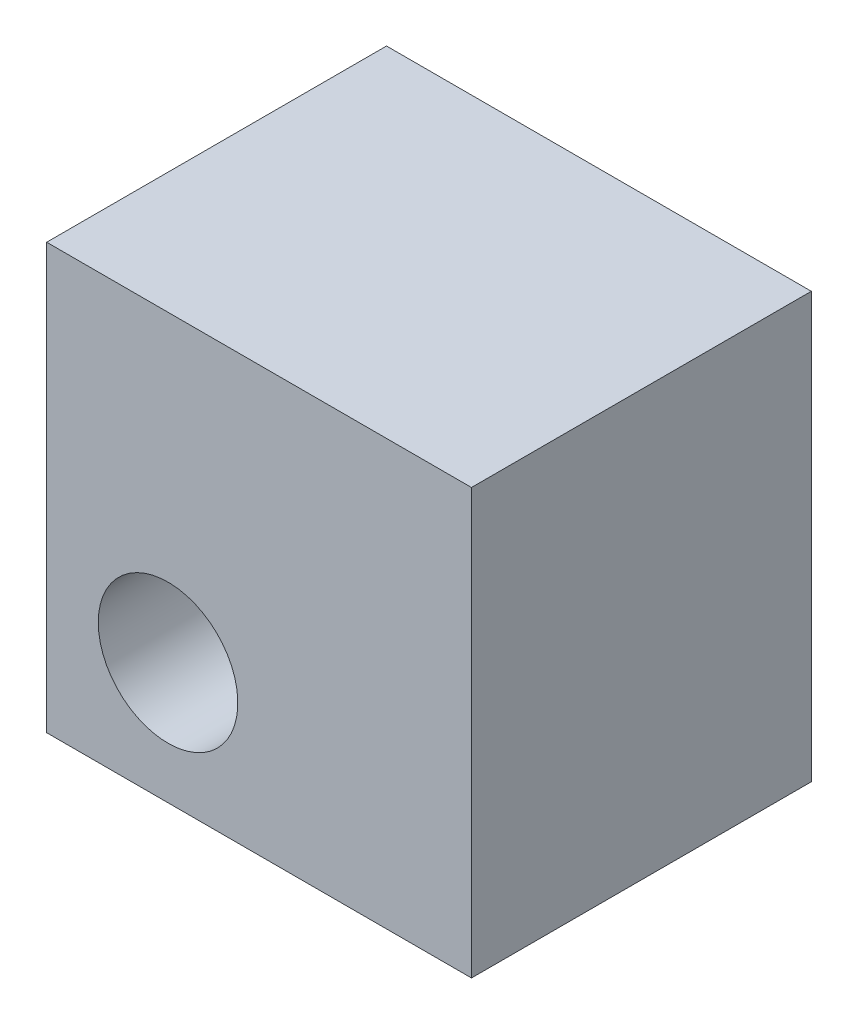
ISO-10303-21;
HEADER;
FILE_DESCRIPTION(('STEP AP214'),'2;1');
FILE_NAME('part.step','',(''),(''),'','','');
FILE_SCHEMA(('AUTOMOTIVE_DESIGN { 1 0 10303 214 1 1 1 1 }'));
ENDSEC;
DATA;
#1=APPLICATION_CONTEXT('core data for automotive mechanical design processes');
#2=APPLICATION_PROTOCOL_DEFINITION('international standard','automotive_design',2000,#1);
#3=PRODUCT_CONTEXT('',#1,'mechanical');
#4=PRODUCT('Part','Part','',(#3));
#5=PRODUCT_RELATED_PRODUCT_CATEGORY('part','',(#4));
#6=PRODUCT_DEFINITION_FORMATION('','',#4);
#7=PRODUCT_DEFINITION_CONTEXT('part definition',#1,'design');
#8=PRODUCT_DEFINITION('design','',#6,#7);
#9=PRODUCT_DEFINITION_SHAPE('','',#8);
#10=(LENGTH_UNIT() NAMED_UNIT(*) SI_UNIT(.MILLI.,.METRE.));
#11=(NAMED_UNIT(*) PLANE_ANGLE_UNIT() SI_UNIT($,.RADIAN.));
#12=(NAMED_UNIT(*) SI_UNIT($,.STERADIAN.) SOLID_ANGLE_UNIT());
#13=UNCERTAINTY_MEASURE_WITH_UNIT(LENGTH_MEASURE(1.E-05),#10,'distance_accuracy_value','');
#14=(GEOMETRIC_REPRESENTATION_CONTEXT(3) GLOBAL_UNCERTAINTY_ASSIGNED_CONTEXT((#13)) GLOBAL_UNIT_ASSIGNED_CONTEXT((#10,
#11,#12)) REPRESENTATION_CONTEXT('',''));
#15=CARTESIAN_POINT('',(0.,0.,0.));
#16=DIRECTION('',(0.,0.,1.));
#17=DIRECTION('',(1.,0.,0.));
#18=AXIS2_PLACEMENT_3D('',#15,#16,#17);
#19=CARTESIAN_POINT('',(0.,0.,5.6));
#20=DIRECTION('',(1.,0.,0.));
#21=DIRECTION('',(0.,0.,-1.));
#22=AXIS2_PLACEMENT_3D('',#19,#20,#21);
#23=PLANE('',#22);
#24=DIRECTION('',(0.,0.,-1.));
#25=VECTOR('',#24,1.);
#26=CARTESIAN_POINT('',(0.,4.5,1.6));
#27=LINE('',#26,#25);
#28=CARTESIAN_POINT('',(0.,4.5,1.6));
#29=VERTEX_POINT('',#28);
#30=CARTESIAN_POINT('',(0.,4.5,0.));
#31=VERTEX_POINT('',#30);
#32=EDGE_CURVE('E55',#29,#31,#27,.T.);
#33=ORIENTED_EDGE('',*,*,#32,.F.);
#34=DIRECTION('',(0.,-1.,0.));
#35=VECTOR('',#34,1.);
#36=CARTESIAN_POINT('',(0.,0.,1.6));
#37=LINE('',#36,#35);
#38=CARTESIAN_POINT('',(0.,0.,1.6));
#39=VERTEX_POINT('',#38);
#40=EDGE_CURVE('E114',#29,#39,#37,.T.);
#41=ORIENTED_EDGE('',*,*,#40,.T.);
#42=DIRECTION('',(0.,0.,-1.));
#43=VECTOR('',#42,1.);
#44=CARTESIAN_POINT('',(0.,0.,5.6));
#45=LINE('',#44,#43);
#46=CARTESIAN_POINT('',(0.,0.,5.6));
#47=VERTEX_POINT('',#46);
#48=EDGE_CURVE('E11',#47,#39,#45,.T.);
#49=ORIENTED_EDGE('',*,*,#48,.F.);
#50=DIRECTION('',(0.,-1.,0.));
#51=VECTOR('',#50,1.);
#52=CARTESIAN_POINT('',(0.,0.,5.6));
#53=LINE('',#52,#51);
#54=CARTESIAN_POINT('',(0.,7.,5.6));
#55=VERTEX_POINT('',#54);
#56=EDGE_CURVE('E193',#55,#47,#53,.T.);
#57=ORIENTED_EDGE('',*,*,#56,.F.);
#58=DIRECTION('',(0.,0.,-1.));
#59=VECTOR('',#58,1.);
#60=CARTESIAN_POINT('',(0.,7.,5.6));
#61=LINE('',#60,#59);
#62=CARTESIAN_POINT('',(0.,7.,0.));
#63=VERTEX_POINT('',#62);
#64=EDGE_CURVE('E203',#55,#63,#61,.T.);
#65=ORIENTED_EDGE('',*,*,#64,.T.);
#66=DIRECTION('',(0.,-1.,0.));
#67=VECTOR('',#66,1.);
#68=CARTESIAN_POINT('',(0.,0.,0.));
#69=LINE('',#68,#67);
#70=EDGE_CURVE('E192',#63,#31,#69,.T.);
#71=ORIENTED_EDGE('',*,*,#70,.T.);
#72=EDGE_LOOP('',(#33,#41,#49,#57,#65,#71));
#73=FACE_BOUND('',#72,.T.);
#74=ADVANCED_FACE('F39',(#73),#23,.F.);
#75=CARTESIAN_POINT('',(0.,0.,5.6));
#76=DIRECTION('',(0.,1.,0.));
#77=DIRECTION('',(0.,0.,1.));
#78=AXIS2_PLACEMENT_3D('',#75,#76,#77);
#79=PLANE('',#78);
#80=DIRECTION('',(0.,0.,-1.));
#81=VECTOR('',#80,1.);
#82=CARTESIAN_POINT('',(4.5,0.,1.6));
#83=LINE('',#82,#81);
#84=CARTESIAN_POINT('',(4.5,0.,1.6));
#85=VERTEX_POINT('',#84);
#86=CARTESIAN_POINT('',(4.5,0.,0.));
#87=VERTEX_POINT('',#86);
#88=EDGE_CURVE('E127',#85,#87,#83,.T.);
#89=ORIENTED_EDGE('',*,*,#88,.T.);
#90=DIRECTION('',(1.,0.,0.));
#91=VECTOR('',#90,1.);
#92=CARTESIAN_POINT('',(0.,0.,0.));
#93=LINE('',#92,#91);
#94=CARTESIAN_POINT('',(7.,0.,0.));
#95=VERTEX_POINT('',#94);
#96=EDGE_CURVE('E206',#87,#95,#93,.T.);
#97=ORIENTED_EDGE('',*,*,#96,.T.);
#98=DIRECTION('',(0.,0.,-1.));
#99=VECTOR('',#98,1.);
#100=CARTESIAN_POINT('',(7.,0.,5.6));
#101=LINE('',#100,#99);
#102=CARTESIAN_POINT('',(7.,0.,5.6));
#103=VERTEX_POINT('',#102);
#104=EDGE_CURVE('E48',#103,#95,#101,.T.);
#105=ORIENTED_EDGE('',*,*,#104,.F.);
#106=DIRECTION('',(1.,0.,0.));
#107=VECTOR('',#106,1.);
#108=CARTESIAN_POINT('',(0.,0.,5.6));
#109=LINE('',#108,#107);
#110=EDGE_CURVE('E89',#47,#103,#109,.T.);
#111=ORIENTED_EDGE('',*,*,#110,.F.);
#112=ORIENTED_EDGE('',*,*,#48,.T.);
#113=DIRECTION('',(1.,0.,0.));
#114=VECTOR('',#113,1.);
#115=CARTESIAN_POINT('',(0.,0.,1.6));
#116=LINE('',#115,#114);
#117=EDGE_CURVE('E110',#39,#85,#116,.T.);
#118=ORIENTED_EDGE('',*,*,#117,.T.);
#119=EDGE_LOOP('',(#89,#97,#105,#111,#112,#118));
#120=FACE_BOUND('',#119,.T.);
#121=ADVANCED_FACE('F126',(#120),#79,.F.);
#122=CARTESIAN_POINT('',(0.,0.,0.));
#123=DIRECTION('',(0.,0.,-1.));
#124=DIRECTION('',(-1.,0.,0.));
#125=AXIS2_PLACEMENT_3D('',#122,#123,#124);
#126=PLANE('',#125);
#127=ORIENTED_EDGE('',*,*,#96,.F.);
#128=DIRECTION('',(0.,1.,0.));
#129=VECTOR('',#128,1.);
#130=CARTESIAN_POINT('',(4.5,0.,0.));
#131=LINE('',#130,#129);
#132=CARTESIAN_POINT('',(4.5,4.5,0.));
#133=VERTEX_POINT('',#132);
#134=EDGE_CURVE('E171',#87,#133,#131,.T.);
#135=ORIENTED_EDGE('',*,*,#134,.T.);
#136=DIRECTION('',(-1.,0.,0.));
#137=VECTOR('',#136,1.);
#138=CARTESIAN_POINT('',(0.,4.5,0.));
#139=LINE('',#138,#137);
#140=EDGE_CURVE('E124',#133,#31,#139,.T.);
#141=ORIENTED_EDGE('',*,*,#140,.T.);
#142=ORIENTED_EDGE('',*,*,#70,.F.);
#143=DIRECTION('',(-1.,0.,0.));
#144=VECTOR('',#143,1.);
#145=CARTESIAN_POINT('',(0.,7.,0.));
#146=LINE('',#145,#144);
#147=CARTESIAN_POINT('',(7.,7.,0.));
#148=VERTEX_POINT('',#147);
#149=EDGE_CURVE('E82',#148,#63,#146,.T.);
#150=ORIENTED_EDGE('',*,*,#149,.F.);
#151=DIRECTION('',(0.,1.,0.));
#152=VECTOR('',#151,1.);
#153=CARTESIAN_POINT('',(7.,0.,0.));
#154=LINE('',#153,#152);
#155=EDGE_CURVE('E209',#95,#148,#154,.T.);
#156=ORIENTED_EDGE('',*,*,#155,.F.);
#157=EDGE_LOOP('',(#127,#135,#141,#142,#150,#156));
#158=FACE_BOUND('',#157,.T.);
#159=ADVANCED_FACE('F130',(#158),#126,.T.);
#160=CARTESIAN_POINT('',(7.,0.,5.6));
#161=DIRECTION('',(-1.,0.,0.));
#162=DIRECTION('',(0.,0.,1.));
#163=AXIS2_PLACEMENT_3D('',#160,#161,#162);
#164=PLANE('',#163);
#165=ORIENTED_EDGE('',*,*,#155,.T.);
#166=DIRECTION('',(0.,0.,-1.));
#167=VECTOR('',#166,1.);
#168=CARTESIAN_POINT('',(7.,7.,5.6));
#169=LINE('',#168,#167);
#170=CARTESIAN_POINT('',(7.,7.,5.6));
#171=VERTEX_POINT('',#170);
#172=EDGE_CURVE('E216',#171,#148,#169,.T.);
#173=ORIENTED_EDGE('',*,*,#172,.F.);
#174=DIRECTION('',(0.,1.,0.));
#175=VECTOR('',#174,1.);
#176=CARTESIAN_POINT('',(7.,0.,5.6));
#177=LINE('',#176,#175);
#178=EDGE_CURVE('E198',#103,#171,#177,.T.);
#179=ORIENTED_EDGE('',*,*,#178,.F.);
#180=ORIENTED_EDGE('',*,*,#104,.T.);
#181=EDGE_LOOP('',(#165,#173,#179,#180));
#182=FACE_BOUND('',#181,.T.);
#183=ADVANCED_FACE('F135',(#182),#164,.F.);
#184=CARTESIAN_POINT('',(0.,7.,5.6));
#185=DIRECTION('',(0.,-1.,0.));
#186=DIRECTION('',(0.,0.,-1.));
#187=AXIS2_PLACEMENT_3D('',#184,#185,#186);
#188=PLANE('',#187);
#189=ORIENTED_EDGE('',*,*,#149,.T.);
#190=ORIENTED_EDGE('',*,*,#64,.F.);
#191=DIRECTION('',(-1.,0.,0.));
#192=VECTOR('',#191,1.);
#193=CARTESIAN_POINT('',(0.,7.,5.6));
#194=LINE('',#193,#192);
#195=EDGE_CURVE('E64',#171,#55,#194,.T.);
#196=ORIENTED_EDGE('',*,*,#195,.F.);
#197=ORIENTED_EDGE('',*,*,#172,.T.);
#198=EDGE_LOOP('',(#189,#190,#196,#197));
#199=FACE_BOUND('',#198,.T.);
#200=ADVANCED_FACE('F141',(#199),#188,.F.);
#201=CARTESIAN_POINT('',(0.,0.,5.6));
#202=DIRECTION('',(0.,0.,-1.));
#203=DIRECTION('',(-1.,0.,0.));
#204=AXIS2_PLACEMENT_3D('',#201,#202,#203);
#205=PLANE('',#204);
#206=CARTESIAN_POINT('',(2.,2.,5.6));
#207=DIRECTION('',(0.,0.,-1.));
#208=DIRECTION('',(-1.,0.,0.));
#209=AXIS2_PLACEMENT_3D('',#206,#207,#208);
#210=CIRCLE('',#209,1.15);
#211=CARTESIAN_POINT('',(0.85,2.,5.6));
#212=VERTEX_POINT('',#211);
#213=EDGE_CURVE('E169',#212,#212,#210,.F.);
#214=ORIENTED_EDGE('',*,*,#213,.F.);
#215=EDGE_LOOP('',(#214));
#216=FACE_BOUND('',#215,.T.);
#217=ORIENTED_EDGE('',*,*,#56,.T.);
#218=ORIENTED_EDGE('',*,*,#110,.T.);
#219=ORIENTED_EDGE('',*,*,#178,.T.);
#220=ORIENTED_EDGE('',*,*,#195,.T.);
#221=EDGE_LOOP('',(#217,#218,#219,#220));
#222=FACE_BOUND('',#221,.T.);
#223=ADVANCED_FACE('F144',(#216,#222),#205,.F.);
#224=CARTESIAN_POINT('',(4.5,0.,1.6));
#225=DIRECTION('',(-1.,0.,0.));
#226=DIRECTION('',(0.,-1.,0.));
#227=AXIS2_PLACEMENT_3D('',#224,#225,#226);
#228=PLANE('',#227);
#229=ORIENTED_EDGE('',*,*,#134,.F.);
#230=ORIENTED_EDGE('',*,*,#88,.F.);
#231=DIRECTION('',(0.,1.,0.));
#232=VECTOR('',#231,1.);
#233=CARTESIAN_POINT('',(4.5,0.,1.6));
#234=LINE('',#233,#232);
#235=CARTESIAN_POINT('',(4.5,4.5,1.6));
#236=VERTEX_POINT('',#235);
#237=EDGE_CURVE('E115',#85,#236,#234,.T.);
#238=ORIENTED_EDGE('',*,*,#237,.T.);
#239=DIRECTION('',(0.,0.,-1.));
#240=VECTOR('',#239,1.);
#241=CARTESIAN_POINT('',(4.5,4.5,1.6));
#242=LINE('',#241,#240);
#243=EDGE_CURVE('E187',#236,#133,#242,.T.);
#244=ORIENTED_EDGE('',*,*,#243,.T.);
#245=EDGE_LOOP('',(#229,#230,#238,#244));
#246=FACE_BOUND('',#245,.T.);
#247=ADVANCED_FACE('F148',(#246),#228,.T.);
#248=CARTESIAN_POINT('',(0.,4.5,1.6));
#249=DIRECTION('',(0.,-1.,0.));
#250=DIRECTION('',(0.,0.,-1.));
#251=AXIS2_PLACEMENT_3D('',#248,#249,#250);
#252=PLANE('',#251);
#253=ORIENTED_EDGE('',*,*,#140,.F.);
#254=ORIENTED_EDGE('',*,*,#243,.F.);
#255=DIRECTION('',(-1.,0.,0.));
#256=VECTOR('',#255,1.);
#257=CARTESIAN_POINT('',(0.,4.5,1.6));
#258=LINE('',#257,#256);
#259=EDGE_CURVE('E180',#236,#29,#258,.T.);
#260=ORIENTED_EDGE('',*,*,#259,.T.);
#261=ORIENTED_EDGE('',*,*,#32,.T.);
#262=EDGE_LOOP('',(#253,#254,#260,#261));
#263=FACE_BOUND('',#262,.T.);
#264=ADVANCED_FACE('F152',(#263),#252,.T.);
#265=CARTESIAN_POINT('',(0.,0.,1.6));
#266=DIRECTION('',(0.,0.,-1.));
#267=DIRECTION('',(-1.,0.,0.));
#268=AXIS2_PLACEMENT_3D('',#265,#266,#267);
#269=PLANE('',#268);
#270=CARTESIAN_POINT('',(2.,2.,1.6));
#271=DIRECTION('',(0.,0.,-1.));
#272=DIRECTION('',(-1.,0.,0.));
#273=AXIS2_PLACEMENT_3D('',#270,#271,#272);
#274=CIRCLE('',#273,1.15);
#275=CARTESIAN_POINT('',(0.85,2.,1.6));
#276=VERTEX_POINT('',#275);
#277=EDGE_CURVE('E42',#276,#276,#274,.F.);
#278=ORIENTED_EDGE('',*,*,#277,.T.);
#279=EDGE_LOOP('',(#278));
#280=FACE_BOUND('',#279,.T.);
#281=ORIENTED_EDGE('',*,*,#40,.F.);
#282=ORIENTED_EDGE('',*,*,#259,.F.);
#283=ORIENTED_EDGE('',*,*,#237,.F.);
#284=ORIENTED_EDGE('',*,*,#117,.F.);
#285=EDGE_LOOP('',(#281,#282,#283,#284));
#286=FACE_BOUND('',#285,.T.);
#287=ADVANCED_FACE('F112',(#280,#286),#269,.T.);
#288=CARTESIAN_POINT('',(2.,2.,11.6));
#289=DIRECTION('',(0.,0.,-1.));
#290=DIRECTION('',(-1.,0.,0.));
#291=AXIS2_PLACEMENT_3D('',#288,#289,#290);
#292=CYLINDRICAL_SURFACE('',#291,1.15);
#293=ORIENTED_EDGE('',*,*,#277,.F.);
#294=EDGE_LOOP('',(#293));
#295=FACE_BOUND('',#294,.T.);
#296=ORIENTED_EDGE('',*,*,#213,.T.);
#297=EDGE_LOOP('',(#296));
#298=FACE_BOUND('',#297,.T.);
#299=ADVANCED_FACE('F158',(#295,#298),#292,.F.);
#300=CLOSED_SHELL('',(#74,#121,#159,#183,#200,#223,#247,#264,#287,#299));
#301=MANIFOLD_SOLID_BREP('B2',#300);
#302=ADVANCED_BREP_SHAPE_REPRESENTATION('',(#18,#301),#14);
#303=SHAPE_DEFINITION_REPRESENTATION(#9,#302);
ENDSEC;
END-ISO-10303-21;
